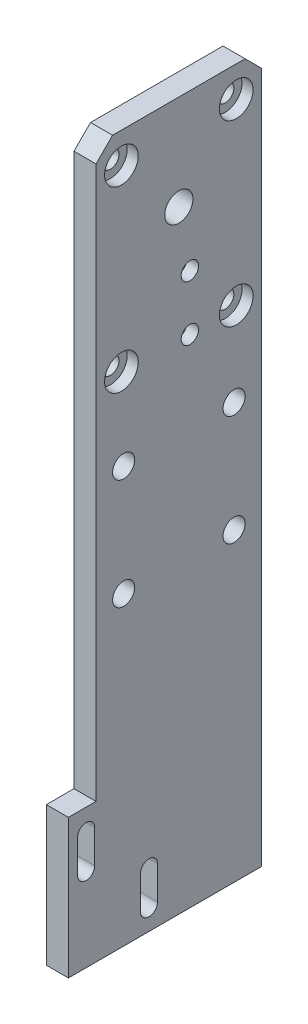
ISO-10303-21;
HEADER;
FILE_DESCRIPTION(('STEP AP214'),'2;1');
FILE_NAME('part.step','',(''),(''),'','','');
FILE_SCHEMA(('AUTOMOTIVE_DESIGN { 1 0 10303 214 1 1 1 1 }'));
ENDSEC;
DATA;
#1=APPLICATION_CONTEXT('core data for automotive mechanical design processes');
#2=APPLICATION_PROTOCOL_DEFINITION('international standard','automotive_design',2000,#1);
#3=PRODUCT_CONTEXT('',#1,'mechanical');
#4=PRODUCT('Part','Part','',(#3));
#5=PRODUCT_RELATED_PRODUCT_CATEGORY('part','',(#4));
#6=PRODUCT_DEFINITION_FORMATION('','',#4);
#7=PRODUCT_DEFINITION_CONTEXT('part definition',#1,'design');
#8=PRODUCT_DEFINITION('design','',#6,#7);
#9=PRODUCT_DEFINITION_SHAPE('','',#8);
#10=(LENGTH_UNIT() NAMED_UNIT(*) SI_UNIT(.MILLI.,.METRE.));
#11=(NAMED_UNIT(*) PLANE_ANGLE_UNIT() SI_UNIT($,.RADIAN.));
#12=(NAMED_UNIT(*) SI_UNIT($,.STERADIAN.) SOLID_ANGLE_UNIT());
#13=UNCERTAINTY_MEASURE_WITH_UNIT(LENGTH_MEASURE(1.E-05),#10,'distance_accuracy_value','');
#14=(GEOMETRIC_REPRESENTATION_CONTEXT(3) GLOBAL_UNCERTAINTY_ASSIGNED_CONTEXT((#13)) GLOBAL_UNIT_ASSIGNED_CONTEXT((#10,
#11,#12)) REPRESENTATION_CONTEXT('',''));
#15=CARTESIAN_POINT('',(0.,0.,0.));
#16=DIRECTION('',(0.,0.,1.));
#17=DIRECTION('',(1.,0.,0.));
#18=AXIS2_PLACEMENT_3D('',#15,#16,#17);
#19=CARTESIAN_POINT('',(-4.99999999997031E-05,25.1,10.4));
#20=DIRECTION('',(1.,0.,0.));
#21=DIRECTION('',(0.,0.,-1.));
#22=AXIS2_PLACEMENT_3D('',#19,#20,#21);
#23=CYLINDRICAL_SURFACE('',#22,1.575);
#24=CARTESIAN_POINT('',(0.,25.1,10.4));
#25=DIRECTION('',(-1.,0.,0.));
#26=DIRECTION('',(0.,0.,1.));
#27=AXIS2_PLACEMENT_3D('',#24,#25,#26);
#28=CIRCLE('',#27,1.575);
#29=CARTESIAN_POINT('',(0.,25.1,11.975));
#30=VERTEX_POINT('',#29);
#31=EDGE_CURVE('E314',#30,#30,#28,.T.);
#32=ORIENTED_EDGE('',*,*,#31,.T.);
#33=EDGE_LOOP('',(#32));
#34=FACE_BOUND('',#33,.T.);
#35=CARTESIAN_POINT('',(2.,25.1,10.4));
#36=DIRECTION('',(1.,0.,0.));
#37=DIRECTION('',(0.,0.,-1.));
#38=AXIS2_PLACEMENT_3D('',#35,#36,#37);
#39=CIRCLE('',#38,1.575);
#40=CARTESIAN_POINT('',(2.,25.1,8.825));
#41=VERTEX_POINT('',#40);
#42=EDGE_CURVE('E36',#41,#41,#39,.F.);
#43=ORIENTED_EDGE('',*,*,#42,.F.);
#44=EDGE_LOOP('',(#43));
#45=FACE_BOUND('',#44,.T.);
#46=ADVANCED_FACE('F32',(#34,#45),#23,.F.);
#47=CARTESIAN_POINT('',(-4.99999999997031E-05,25.1,-10.4));
#48=DIRECTION('',(1.,0.,0.));
#49=DIRECTION('',(0.,0.,-1.));
#50=AXIS2_PLACEMENT_3D('',#47,#48,#49);
#51=CYLINDRICAL_SURFACE('',#50,1.575);
#52=CARTESIAN_POINT('',(0.,25.1,-10.4));
#53=DIRECTION('',(-1.,0.,0.));
#54=DIRECTION('',(0.,0.,1.));
#55=AXIS2_PLACEMENT_3D('',#52,#53,#54);
#56=CIRCLE('',#55,1.575);
#57=CARTESIAN_POINT('',(0.,25.1,-8.825));
#58=VERTEX_POINT('',#57);
#59=EDGE_CURVE('E317',#58,#58,#56,.T.);
#60=ORIENTED_EDGE('',*,*,#59,.T.);
#61=EDGE_LOOP('',(#60));
#62=FACE_BOUND('',#61,.T.);
#63=CARTESIAN_POINT('',(2.,25.1,-10.4));
#64=DIRECTION('',(1.,0.,0.));
#65=DIRECTION('',(0.,0.,-1.));
#66=AXIS2_PLACEMENT_3D('',#63,#64,#65);
#67=CIRCLE('',#66,1.575);
#68=CARTESIAN_POINT('',(2.,25.1,-11.975));
#69=VERTEX_POINT('',#68);
#70=EDGE_CURVE('E185',#69,#69,#67,.F.);
#71=ORIENTED_EDGE('',*,*,#70,.F.);
#72=EDGE_LOOP('',(#71));
#73=FACE_BOUND('',#72,.T.);
#74=ADVANCED_FACE('F359',(#62,#73),#51,.F.);
#75=CARTESIAN_POINT('',(-4.99999999997031E-05,57.45,-10.4));
#76=DIRECTION('',(1.,0.,0.));
#77=DIRECTION('',(0.,0.,-1.));
#78=AXIS2_PLACEMENT_3D('',#75,#76,#77);
#79=CYLINDRICAL_SURFACE('',#78,1.575);
#80=CARTESIAN_POINT('',(0.,57.45,-10.4));
#81=DIRECTION('',(-1.,0.,0.));
#82=DIRECTION('',(0.,0.,1.));
#83=AXIS2_PLACEMENT_3D('',#80,#81,#82);
#84=CIRCLE('',#83,1.575);
#85=CARTESIAN_POINT('',(0.,57.45,-8.825));
#86=VERTEX_POINT('',#85);
#87=EDGE_CURVE('E311',#86,#86,#84,.T.);
#88=ORIENTED_EDGE('',*,*,#87,.T.);
#89=EDGE_LOOP('',(#88));
#90=FACE_BOUND('',#89,.T.);
#91=CARTESIAN_POINT('',(2.,57.45,-10.4));
#92=DIRECTION('',(1.,0.,0.));
#93=DIRECTION('',(0.,0.,-1.));
#94=AXIS2_PLACEMENT_3D('',#91,#92,#93);
#95=CIRCLE('',#94,1.575);
#96=CARTESIAN_POINT('',(2.,57.45,-11.975));
#97=VERTEX_POINT('',#96);
#98=EDGE_CURVE('E192',#97,#97,#95,.F.);
#99=ORIENTED_EDGE('',*,*,#98,.F.);
#100=EDGE_LOOP('',(#99));
#101=FACE_BOUND('',#100,.T.);
#102=ADVANCED_FACE('F361',(#90,#101),#79,.F.);
#103=CARTESIAN_POINT('',(-4.99999999997031E-05,57.45,10.4));
#104=DIRECTION('',(1.,0.,0.));
#105=DIRECTION('',(0.,0.,-1.));
#106=AXIS2_PLACEMENT_3D('',#103,#104,#105);
#107=CYLINDRICAL_SURFACE('',#106,1.575);
#108=CARTESIAN_POINT('',(0.,57.45,10.4));
#109=DIRECTION('',(-1.,0.,0.));
#110=DIRECTION('',(0.,0.,1.));
#111=AXIS2_PLACEMENT_3D('',#108,#109,#110);
#112=CIRCLE('',#111,1.575);
#113=CARTESIAN_POINT('',(0.,57.45,11.975));
#114=VERTEX_POINT('',#113);
#115=EDGE_CURVE('E221',#114,#114,#112,.T.);
#116=ORIENTED_EDGE('',*,*,#115,.T.);
#117=EDGE_LOOP('',(#116));
#118=FACE_BOUND('',#117,.T.);
#119=CARTESIAN_POINT('',(2.,57.45,10.4));
#120=DIRECTION('',(1.,0.,0.));
#121=DIRECTION('',(0.,0.,-1.));
#122=AXIS2_PLACEMENT_3D('',#119,#120,#121);
#123=CIRCLE('',#122,1.575);
#124=CARTESIAN_POINT('',(2.,57.45,8.825));
#125=VERTEX_POINT('',#124);
#126=EDGE_CURVE('E199',#125,#125,#123,.F.);
#127=ORIENTED_EDGE('',*,*,#126,.F.);
#128=EDGE_LOOP('',(#127));
#129=FACE_BOUND('',#128,.T.);
#130=ADVANCED_FACE('F368',(#118,#129),#107,.F.);
#131=CARTESIAN_POINT('',(-4.99999999997031E-05,34.75,-2.));
#132=DIRECTION('',(1.,0.,0.));
#133=DIRECTION('',(0.,0.,-1.));
#134=AXIS2_PLACEMENT_3D('',#131,#132,#133);
#135=CYLINDRICAL_SURFACE('',#134,1.575);
#136=CARTESIAN_POINT('',(4.,34.75,-2.));
#137=DIRECTION('',(1.,0.,0.));
#138=DIRECTION('',(0.,0.,-1.));
#139=AXIS2_PLACEMENT_3D('',#136,#137,#138);
#140=CIRCLE('',#139,1.575);
#141=CARTESIAN_POINT('',(4.,34.75,-3.575));
#142=VERTEX_POINT('',#141);
#143=EDGE_CURVE('E220',#142,#142,#140,.T.);
#144=ORIENTED_EDGE('',*,*,#143,.T.);
#145=EDGE_LOOP('',(#144));
#146=FACE_BOUND('',#145,.T.);
#147=CARTESIAN_POINT('',(1.9,34.75,-2.));
#148=DIRECTION('',(-1.,0.,0.));
#149=DIRECTION('',(0.,0.,1.));
#150=AXIS2_PLACEMENT_3D('',#147,#148,#149);
#151=CIRCLE('',#150,1.575);
#152=CARTESIAN_POINT('',(1.9,34.75,-0.424999999999998));
#153=VERTEX_POINT('',#152);
#154=EDGE_CURVE('E206',#153,#153,#151,.F.);
#155=ORIENTED_EDGE('',*,*,#154,.F.);
#156=EDGE_LOOP('',(#155));
#157=FACE_BOUND('',#156,.T.);
#158=ADVANCED_FACE('F379',(#146,#157),#135,.F.);
#159=CARTESIAN_POINT('',(-4.99999999997031E-05,24.75,-2.));
#160=DIRECTION('',(1.,0.,0.));
#161=DIRECTION('',(0.,0.,-1.));
#162=AXIS2_PLACEMENT_3D('',#159,#160,#161);
#163=CYLINDRICAL_SURFACE('',#162,1.575);
#164=CARTESIAN_POINT('',(4.,24.75,-2.));
#165=DIRECTION('',(1.,0.,0.));
#166=DIRECTION('',(0.,0.,-1.));
#167=AXIS2_PLACEMENT_3D('',#164,#165,#166);
#168=CIRCLE('',#167,1.575);
#169=CARTESIAN_POINT('',(4.,24.75,-3.575));
#170=VERTEX_POINT('',#169);
#171=EDGE_CURVE('E217',#170,#170,#168,.T.);
#172=ORIENTED_EDGE('',*,*,#171,.T.);
#173=EDGE_LOOP('',(#172));
#174=FACE_BOUND('',#173,.T.);
#175=CARTESIAN_POINT('',(1.9,24.75,-2.));
#176=DIRECTION('',(-1.,0.,0.));
#177=DIRECTION('',(0.,0.,1.));
#178=AXIS2_PLACEMENT_3D('',#175,#176,#177);
#179=CIRCLE('',#178,1.575);
#180=CARTESIAN_POINT('',(1.9,24.75,-0.424999999999999));
#181=VERTEX_POINT('',#180);
#182=EDGE_CURVE('E213',#181,#181,#179,.F.);
#183=ORIENTED_EDGE('',*,*,#182,.F.);
#184=EDGE_LOOP('',(#183));
#185=FACE_BOUND('',#184,.T.);
#186=ADVANCED_FACE('F381',(#174,#185),#163,.F.);
#187=CARTESIAN_POINT('',(4.,-63.,15.));
#188=DIRECTION('',(0.,0.,-1.));
#189=DIRECTION('',(-1.,0.,0.));
#190=AXIS2_PLACEMENT_3D('',#187,#188,#189);
#191=PLANE('',#190);
#192=DIRECTION('',(0.,-1.,0.));
#193=VECTOR('',#192,1.);
#194=CARTESIAN_POINT('',(4.,-63.,15.));
#195=LINE('',#194,#193);
#196=CARTESIAN_POINT('',(4.,60.,15.));
#197=VERTEX_POINT('',#196);
#198=CARTESIAN_POINT('',(4.,-40.,15.));
#199=VERTEX_POINT('',#198);
#200=EDGE_CURVE('E292',#197,#199,#195,.T.);
#201=ORIENTED_EDGE('',*,*,#200,.F.);
#202=DIRECTION('',(-1.,0.,0.));
#203=VECTOR('',#202,1.);
#204=CARTESIAN_POINT('',(4.,60.,15.));
#205=LINE('',#204,#203);
#206=CARTESIAN_POINT('',(0.,60.,15.));
#207=VERTEX_POINT('',#206);
#208=EDGE_CURVE('E11',#197,#207,#205,.T.);
#209=ORIENTED_EDGE('',*,*,#208,.T.);
#210=DIRECTION('',(0.,-1.,0.));
#211=VECTOR('',#210,1.);
#212=CARTESIAN_POINT('',(0.,-63.,15.));
#213=LINE('',#212,#211);
#214=CARTESIAN_POINT('',(0.,-40.,15.));
#215=VERTEX_POINT('',#214);
#216=EDGE_CURVE('E325',#207,#215,#213,.T.);
#217=ORIENTED_EDGE('',*,*,#216,.T.);
#218=DIRECTION('',(-1.,0.,0.));
#219=VECTOR('',#218,1.);
#220=CARTESIAN_POINT('',(27.5372045918796,-40.,15.));
#221=LINE('',#220,#219);
#222=EDGE_CURVE('E268',#199,#215,#221,.T.);
#223=ORIENTED_EDGE('',*,*,#222,.F.);
#224=EDGE_LOOP('',(#201,#209,#217,#223));
#225=FACE_BOUND('',#224,.T.);
#226=ADVANCED_FACE('F384',(#225),#191,.F.);
#227=CARTESIAN_POINT('',(4.,-63.,-15.));
#228=DIRECTION('',(0.,0.,1.));
#229=DIRECTION('',(1.,0.,0.));
#230=AXIS2_PLACEMENT_3D('',#227,#228,#229);
#231=PLANE('',#230);
#232=DIRECTION('',(0.,1.,0.));
#233=VECTOR('',#232,1.);
#234=CARTESIAN_POINT('',(0.,-63.,-15.));
#235=LINE('',#234,#233);
#236=CARTESIAN_POINT('',(0.,-65.2,-15.));
#237=VERTEX_POINT('',#236);
#238=CARTESIAN_POINT('',(0.,60.,-15.));
#239=VERTEX_POINT('',#238);
#240=EDGE_CURVE('E148',#237,#239,#235,.T.);
#241=ORIENTED_EDGE('',*,*,#240,.T.);
#242=DIRECTION('',(1.,0.,0.));
#243=VECTOR('',#242,1.);
#244=CARTESIAN_POINT('',(4.,60.,-15.));
#245=LINE('',#244,#243);
#246=CARTESIAN_POINT('',(4.,60.,-15.));
#247=VERTEX_POINT('',#246);
#248=EDGE_CURVE('E57',#239,#247,#245,.T.);
#249=ORIENTED_EDGE('',*,*,#248,.T.);
#250=DIRECTION('',(0.,1.,0.));
#251=VECTOR('',#250,1.);
#252=CARTESIAN_POINT('',(4.,-63.,-15.));
#253=LINE('',#252,#251);
#254=CARTESIAN_POINT('',(4.,-65.2,-15.));
#255=VERTEX_POINT('',#254);
#256=EDGE_CURVE('E163',#255,#247,#253,.T.);
#257=ORIENTED_EDGE('',*,*,#256,.F.);
#258=DIRECTION('',(1.,0.,0.));
#259=VECTOR('',#258,1.);
#260=CARTESIAN_POINT('',(-35.0690746955205,-65.2,-15.));
#261=LINE('',#260,#259);
#262=EDGE_CURVE('E161',#237,#255,#261,.T.);
#263=ORIENTED_EDGE('',*,*,#262,.F.);
#264=EDGE_LOOP('',(#241,#249,#257,#263));
#265=FACE_BOUND('',#264,.T.);
#266=ADVANCED_FACE('F162',(#265),#231,.F.);
#267=CARTESIAN_POINT('',(4.,63.,15.));
#268=DIRECTION('',(0.,-1.,0.));
#269=DIRECTION('',(0.,0.,-1.));
#270=AXIS2_PLACEMENT_3D('',#267,#268,#269);
#271=PLANE('',#270);
#272=DIRECTION('',(0.,0.,1.));
#273=VECTOR('',#272,1.);
#274=CARTESIAN_POINT('',(4.,63.,15.));
#275=LINE('',#274,#273);
#276=CARTESIAN_POINT('',(4.,63.,-12.));
#277=VERTEX_POINT('',#276);
#278=CARTESIAN_POINT('',(4.,63.,12.));
#279=VERTEX_POINT('',#278);
#280=EDGE_CURVE('E332',#277,#279,#275,.T.);
#281=ORIENTED_EDGE('',*,*,#280,.F.);
#282=DIRECTION('',(-1.,0.,0.));
#283=VECTOR('',#282,1.);
#284=CARTESIAN_POINT('',(4.,63.,-12.));
#285=LINE('',#284,#283);
#286=CARTESIAN_POINT('',(0.,63.,-12.));
#287=VERTEX_POINT('',#286);
#288=EDGE_CURVE('E321',#277,#287,#285,.T.);
#289=ORIENTED_EDGE('',*,*,#288,.T.);
#290=DIRECTION('',(0.,0.,1.));
#291=VECTOR('',#290,1.);
#292=CARTESIAN_POINT('',(0.,63.,15.));
#293=LINE('',#292,#291);
#294=CARTESIAN_POINT('',(0.,63.,12.));
#295=VERTEX_POINT('',#294);
#296=EDGE_CURVE('E157',#287,#295,#293,.T.);
#297=ORIENTED_EDGE('',*,*,#296,.T.);
#298=DIRECTION('',(1.,0.,0.));
#299=VECTOR('',#298,1.);
#300=CARTESIAN_POINT('',(4.,63.,12.));
#301=LINE('',#300,#299);
#302=EDGE_CURVE('E308',#295,#279,#301,.T.);
#303=ORIENTED_EDGE('',*,*,#302,.T.);
#304=EDGE_LOOP('',(#281,#289,#297,#303));
#305=FACE_BOUND('',#304,.T.);
#306=ADVANCED_FACE('F341',(#305),#271,.F.);
#307=CARTESIAN_POINT('',(4.,0.,0.));
#308=DIRECTION('',(-1.,0.,0.));
#309=DIRECTION('',(0.,0.,1.));
#310=AXIS2_PLACEMENT_3D('',#307,#308,#309);
#311=PLANE('',#310);
#312=CARTESIAN_POINT('',(4.,25.1,10.4));
#313=DIRECTION('',(1.,0.,0.));
#314=DIRECTION('',(0.,0.,-1.));
#315=AXIS2_PLACEMENT_3D('',#312,#313,#314);
#316=CIRCLE('',#315,3.05);
#317=CARTESIAN_POINT('',(4.,25.1,7.35));
#318=VERTEX_POINT('',#317);
#319=EDGE_CURVE('E176',#318,#318,#316,.T.);
#320=ORIENTED_EDGE('',*,*,#319,.F.);
#321=EDGE_LOOP('',(#320));
#322=FACE_BOUND('',#321,.T.);
#323=CARTESIAN_POINT('',(4.,25.1,-10.4));
#324=DIRECTION('',(1.,0.,0.));
#325=DIRECTION('',(0.,0.,-1.));
#326=AXIS2_PLACEMENT_3D('',#323,#324,#325);
#327=CIRCLE('',#326,3.05);
#328=CARTESIAN_POINT('',(4.,25.1,-13.45));
#329=VERTEX_POINT('',#328);
#330=EDGE_CURVE('E186',#329,#329,#327,.T.);
#331=ORIENTED_EDGE('',*,*,#330,.F.);
#332=EDGE_LOOP('',(#331));
#333=FACE_BOUND('',#332,.T.);
#334=CARTESIAN_POINT('',(4.,57.45,-10.4));
#335=DIRECTION('',(1.,0.,0.));
#336=DIRECTION('',(0.,0.,-1.));
#337=AXIS2_PLACEMENT_3D('',#334,#335,#336);
#338=CIRCLE('',#337,3.05);
#339=CARTESIAN_POINT('',(4.,57.45,-13.45));
#340=VERTEX_POINT('',#339);
#341=EDGE_CURVE('E193',#340,#340,#338,.T.);
#342=ORIENTED_EDGE('',*,*,#341,.F.);
#343=EDGE_LOOP('',(#342));
#344=FACE_BOUND('',#343,.T.);
#345=CARTESIAN_POINT('',(4.,57.45,10.4));
#346=DIRECTION('',(1.,0.,0.));
#347=DIRECTION('',(0.,0.,-1.));
#348=AXIS2_PLACEMENT_3D('',#345,#346,#347);
#349=CIRCLE('',#348,3.04999999999999);
#350=CARTESIAN_POINT('',(4.,57.45,7.35000000000001));
#351=VERTEX_POINT('',#350);
#352=EDGE_CURVE('E200',#351,#351,#349,.T.);
#353=ORIENTED_EDGE('',*,*,#352,.F.);
#354=EDGE_LOOP('',(#353));
#355=FACE_BOUND('',#354,.T.);
#356=ORIENTED_EDGE('',*,*,#171,.F.);
#357=EDGE_LOOP('',(#356));
#358=FACE_BOUND('',#357,.T.);
#359=ORIENTED_EDGE('',*,*,#143,.F.);
#360=EDGE_LOOP('',(#359));
#361=FACE_BOUND('',#360,.T.);
#362=DIRECTION('',(0.,-1.,0.));
#363=VECTOR('',#362,1.);
#364=CARTESIAN_POINT('',(4.,-55.3437084989847,6.95718189636012));
#365=LINE('',#364,#363);
#366=CARTESIAN_POINT('',(4.,-55.3437084989847,6.95718189636012));
#367=VERTEX_POINT('',#366);
#368=CARTESIAN_POINT('',(4.,-61.3437084989847,6.95718189636012));
#369=VERTEX_POINT('',#368);
#370=EDGE_CURVE('E226',#367,#369,#365,.T.);
#371=ORIENTED_EDGE('',*,*,#370,.F.);
#372=CARTESIAN_POINT('',(4.,-55.3437084989847,5.40718189636012));
#373=DIRECTION('',(1.,0.,0.));
#374=DIRECTION('',(0.,0.,-1.));
#375=AXIS2_PLACEMENT_3D('',#372,#373,#374);
#376=CIRCLE('',#375,1.55);
#377=CARTESIAN_POINT('',(4.,-55.3437084989847,3.85718189636012));
#378=VERTEX_POINT('',#377);
#379=EDGE_CURVE('E224',#378,#367,#376,.T.);
#380=ORIENTED_EDGE('',*,*,#379,.F.);
#381=DIRECTION('',(0.,1.,0.));
#382=VECTOR('',#381,1.);
#383=CARTESIAN_POINT('',(4.,-55.3437084989847,3.85718189636012));
#384=LINE('',#383,#382);
#385=CARTESIAN_POINT('',(4.,-61.3437084989847,3.85718189636012));
#386=VERTEX_POINT('',#385);
#387=EDGE_CURVE('E232',#386,#378,#384,.T.);
#388=ORIENTED_EDGE('',*,*,#387,.F.);
#389=CARTESIAN_POINT('',(4.,-61.3437084989847,5.40718189636012));
#390=DIRECTION('',(1.,0.,0.));
#391=DIRECTION('',(0.,0.,-1.));
#392=AXIS2_PLACEMENT_3D('',#389,#390,#391);
#393=CIRCLE('',#392,1.55);
#394=EDGE_CURVE('E229',#369,#386,#393,.T.);
#395=ORIENTED_EDGE('',*,*,#394,.F.);
#396=EDGE_LOOP('',(#371,#380,#388,#395));
#397=FACE_BOUND('',#396,.T.);
#398=DIRECTION('',(0.,-1.,0.));
#399=VECTOR('',#398,1.);
#400=CARTESIAN_POINT('',(4.,-43.96,18.3408903953449));
#401=LINE('',#400,#399);
#402=CARTESIAN_POINT('',(4.,-43.96,18.3408903953449));
#403=VERTEX_POINT('',#402);
#404=CARTESIAN_POINT('',(4.,-49.96,18.3408903953449));
#405=VERTEX_POINT('',#404);
#406=EDGE_CURVE('E246',#403,#405,#401,.T.);
#407=ORIENTED_EDGE('',*,*,#406,.F.);
#408=CARTESIAN_POINT('',(4.,-43.96,16.7908903953449));
#409=DIRECTION('',(1.,0.,0.));
#410=DIRECTION('',(0.,0.,-1.));
#411=AXIS2_PLACEMENT_3D('',#408,#409,#410);
#412=CIRCLE('',#411,1.55);
#413=CARTESIAN_POINT('',(4.,-43.96,15.2408903953449));
#414=VERTEX_POINT('',#413);
#415=EDGE_CURVE('E238',#414,#403,#412,.T.);
#416=ORIENTED_EDGE('',*,*,#415,.F.);
#417=DIRECTION('',(0.,1.,0.));
#418=VECTOR('',#417,1.);
#419=CARTESIAN_POINT('',(4.,-43.96,15.2408903953449));
#420=LINE('',#419,#418);
#421=CARTESIAN_POINT('',(4.,-49.96,15.2408903953449));
#422=VERTEX_POINT('',#421);
#423=EDGE_CURVE('E252',#422,#414,#420,.T.);
#424=ORIENTED_EDGE('',*,*,#423,.F.);
#425=CARTESIAN_POINT('',(4.,-49.96,16.7908903953449));
#426=DIRECTION('',(1.,0.,0.));
#427=DIRECTION('',(0.,0.,-1.));
#428=AXIS2_PLACEMENT_3D('',#425,#426,#427);
#429=CIRCLE('',#428,1.55);
#430=EDGE_CURVE('E249',#405,#422,#429,.T.);
#431=ORIENTED_EDGE('',*,*,#430,.F.);
#432=EDGE_LOOP('',(#407,#416,#424,#431));
#433=FACE_BOUND('',#432,.T.);
#434=CARTESIAN_POINT('',(4.,45.75,0.));
#435=DIRECTION('',(-1.,0.,0.));
#436=DIRECTION('',(0.,0.,1.));
#437=AXIS2_PLACEMENT_3D('',#434,#435,#436);
#438=CIRCLE('',#437,2.54999999999999);
#439=CARTESIAN_POINT('',(4.,45.75,2.54999999999999));
#440=VERTEX_POINT('',#439);
#441=EDGE_CURVE('E804',#440,#440,#438,.T.);
#442=ORIENTED_EDGE('',*,*,#441,.T.);
#443=EDGE_LOOP('',(#442));
#444=FACE_BOUND('',#443,.T.);
#445=CARTESIAN_POINT('',(4.,-9.90000000000001,-10.));
#446=DIRECTION('',(1.,0.,0.));
#447=DIRECTION('',(0.,0.,-1.));
#448=AXIS2_PLACEMENT_3D('',#445,#446,#447);
#449=CIRCLE('',#448,2.00000000000001);
#450=CARTESIAN_POINT('',(4.,-9.90000000000001,-12.));
#451=VERTEX_POINT('',#450);
#452=EDGE_CURVE('E808',#451,#451,#449,.T.);
#453=ORIENTED_EDGE('',*,*,#452,.F.);
#454=EDGE_LOOP('',(#453));
#455=FACE_BOUND('',#454,.T.);
#456=CARTESIAN_POINT('',(4.,-9.90000000000001,10.));
#457=DIRECTION('',(1.,0.,0.));
#458=DIRECTION('',(0.,0.,-1.));
#459=AXIS2_PLACEMENT_3D('',#456,#457,#458);
#460=CIRCLE('',#459,2.);
#461=CARTESIAN_POINT('',(4.,-9.90000000000001,8.));
#462=VERTEX_POINT('',#461);
#463=EDGE_CURVE('E812',#462,#462,#460,.T.);
#464=ORIENTED_EDGE('',*,*,#463,.F.);
#465=EDGE_LOOP('',(#464));
#466=FACE_BOUND('',#465,.T.);
#467=CARTESIAN_POINT('',(4.,10.1,-10.));
#468=DIRECTION('',(1.,0.,0.));
#469=DIRECTION('',(0.,0.,-1.));
#470=AXIS2_PLACEMENT_3D('',#467,#468,#469);
#471=CIRCLE('',#470,2.00000000000001);
#472=CARTESIAN_POINT('',(4.,10.1,-12.));
#473=VERTEX_POINT('',#472);
#474=EDGE_CURVE('E816',#473,#473,#471,.T.);
#475=ORIENTED_EDGE('',*,*,#474,.F.);
#476=EDGE_LOOP('',(#475));
#477=FACE_BOUND('',#476,.T.);
#478=CARTESIAN_POINT('',(4.,10.1,10.));
#479=DIRECTION('',(1.,0.,0.));
#480=DIRECTION('',(0.,0.,-1.));
#481=AXIS2_PLACEMENT_3D('',#478,#479,#480);
#482=CIRCLE('',#481,2.);
#483=CARTESIAN_POINT('',(4.,10.1,8.));
#484=VERTEX_POINT('',#483);
#485=EDGE_CURVE('E819',#484,#484,#482,.T.);
#486=ORIENTED_EDGE('',*,*,#485,.F.);
#487=EDGE_LOOP('',(#486));
#488=FACE_BOUND('',#487,.T.);
#489=ORIENTED_EDGE('',*,*,#256,.T.);
#490=DIRECTION('',(0.,-0.707106781186549,-0.707106781186546));
#491=VECTOR('',#490,1.);
#492=CARTESIAN_POINT('',(4.,63.,-12.));
#493=LINE('',#492,#491);
#494=EDGE_CURVE('E41',#247,#277,#493,.F.);
#495=ORIENTED_EDGE('',*,*,#494,.T.);
#496=ORIENTED_EDGE('',*,*,#280,.T.);
#497=DIRECTION('',(0.,0.707106781186544,-0.707106781186551));
#498=VECTOR('',#497,1.);
#499=CARTESIAN_POINT('',(4.,60.,15.));
#500=LINE('',#499,#498);
#501=EDGE_CURVE('E49',#279,#197,#500,.F.);
#502=ORIENTED_EDGE('',*,*,#501,.T.);
#503=ORIENTED_EDGE('',*,*,#200,.T.);
#504=DIRECTION('',(0.,0.,1.));
#505=VECTOR('',#504,1.);
#506=CARTESIAN_POINT('',(4.,-40.,15.));
#507=LINE('',#506,#505);
#508=CARTESIAN_POINT('',(4.,-40.,20.));
#509=VERTEX_POINT('',#508);
#510=EDGE_CURVE('E267',#199,#509,#507,.T.);
#511=ORIENTED_EDGE('',*,*,#510,.T.);
#512=DIRECTION('',(0.,-1.,0.));
#513=VECTOR('',#512,1.);
#514=CARTESIAN_POINT('',(4.,-63.,20.));
#515=LINE('',#514,#513);
#516=CARTESIAN_POINT('',(4.,-65.2,20.));
#517=VERTEX_POINT('',#516);
#518=EDGE_CURVE('E265',#509,#517,#515,.T.);
#519=ORIENTED_EDGE('',*,*,#518,.T.);
#520=DIRECTION('',(0.,0.,-1.));
#521=VECTOR('',#520,1.);
#522=CARTESIAN_POINT('',(4.,-65.2,20.));
#523=LINE('',#522,#521);
#524=EDGE_CURVE('E171',#517,#255,#523,.T.);
#525=ORIENTED_EDGE('',*,*,#524,.T.);
#526=EDGE_LOOP('',(#489,#495,#496,#502,#503,#511,#519,#525));
#527=FACE_BOUND('',#526,.T.);
#528=ADVANCED_FACE('F450',(#322,#333,#344,#355,#358,#361,#397,#433,#444,#455,#466,#477,#488,
#527),#311,.F.);
#529=CARTESIAN_POINT('',(0.,0.,0.));
#530=DIRECTION('',(-1.,0.,0.));
#531=DIRECTION('',(0.,0.,1.));
#532=AXIS2_PLACEMENT_3D('',#529,#530,#531);
#533=PLANE('',#532);
#534=CARTESIAN_POINT('',(0.,34.75,-2.));
#535=DIRECTION('',(-1.,0.,0.));
#536=DIRECTION('',(0.,0.,1.));
#537=AXIS2_PLACEMENT_3D('',#534,#535,#536);
#538=CIRCLE('',#537,3.50000000000001);
#539=CARTESIAN_POINT('',(0.,34.75,1.50000000000001));
#540=VERTEX_POINT('',#539);
#541=EDGE_CURVE('E207',#540,#540,#538,.T.);
#542=ORIENTED_EDGE('',*,*,#541,.F.);
#543=EDGE_LOOP('',(#542));
#544=FACE_BOUND('',#543,.T.);
#545=CARTESIAN_POINT('',(0.,24.75,-2.));
#546=DIRECTION('',(-1.,0.,0.));
#547=DIRECTION('',(0.,0.,1.));
#548=AXIS2_PLACEMENT_3D('',#545,#546,#547);
#549=CIRCLE('',#548,3.5);
#550=CARTESIAN_POINT('',(0.,24.75,1.5));
#551=VERTEX_POINT('',#550);
#552=EDGE_CURVE('E214',#551,#551,#549,.T.);
#553=ORIENTED_EDGE('',*,*,#552,.F.);
#554=EDGE_LOOP('',(#553));
#555=FACE_BOUND('',#554,.T.);
#556=ORIENTED_EDGE('',*,*,#59,.F.);
#557=EDGE_LOOP('',(#556));
#558=FACE_BOUND('',#557,.T.);
#559=ORIENTED_EDGE('',*,*,#31,.F.);
#560=EDGE_LOOP('',(#559));
#561=FACE_BOUND('',#560,.T.);
#562=ORIENTED_EDGE('',*,*,#87,.F.);
#563=EDGE_LOOP('',(#562));
#564=FACE_BOUND('',#563,.T.);
#565=ORIENTED_EDGE('',*,*,#115,.F.);
#566=EDGE_LOOP('',(#565));
#567=FACE_BOUND('',#566,.T.);
#568=CARTESIAN_POINT('',(0.,-55.3437084989847,5.40718189636012));
#569=DIRECTION('',(-1.,0.,0.));
#570=DIRECTION('',(0.,0.,1.));
#571=AXIS2_PLACEMENT_3D('',#568,#569,#570);
#572=CIRCLE('',#571,1.55);
#573=CARTESIAN_POINT('',(0.,-55.3437084989847,6.95718189636012));
#574=VERTEX_POINT('',#573);
#575=CARTESIAN_POINT('',(0.,-55.3437084989847,3.85718189636012));
#576=VERTEX_POINT('',#575);
#577=EDGE_CURVE('E306',#574,#576,#572,.T.);
#578=ORIENTED_EDGE('',*,*,#577,.F.);
#579=DIRECTION('',(0.,1.,0.));
#580=VECTOR('',#579,1.);
#581=CARTESIAN_POINT('',(0.,0.,6.95718189636012));
#582=LINE('',#581,#580);
#583=CARTESIAN_POINT('',(0.,-61.3437084989847,6.95718189636012));
#584=VERTEX_POINT('',#583);
#585=EDGE_CURVE('E299',#584,#574,#582,.T.);
#586=ORIENTED_EDGE('',*,*,#585,.F.);
#587=CARTESIAN_POINT('',(0.,-61.3437084989847,5.40718189636012));
#588=DIRECTION('',(-1.,0.,0.));
#589=DIRECTION('',(0.,0.,1.));
#590=AXIS2_PLACEMENT_3D('',#587,#588,#589);
#591=CIRCLE('',#590,1.55);
#592=CARTESIAN_POINT('',(0.,-61.3437084989847,3.85718189636012));
#593=VERTEX_POINT('',#592);
#594=EDGE_CURVE('E301',#593,#584,#591,.T.);
#595=ORIENTED_EDGE('',*,*,#594,.F.);
#596=DIRECTION('',(0.,-1.,0.));
#597=VECTOR('',#596,1.);
#598=CARTESIAN_POINT('',(0.,0.,3.85718189636012));
#599=LINE('',#598,#597);
#600=EDGE_CURVE('E304',#576,#593,#599,.T.);
#601=ORIENTED_EDGE('',*,*,#600,.F.);
#602=EDGE_LOOP('',(#578,#586,#595,#601));
#603=FACE_BOUND('',#602,.T.);
#604=CARTESIAN_POINT('',(0.,-43.96,16.7908903953449));
#605=DIRECTION('',(-1.,0.,0.));
#606=DIRECTION('',(0.,0.,1.));
#607=AXIS2_PLACEMENT_3D('',#604,#605,#606);
#608=CIRCLE('',#607,1.55);
#609=CARTESIAN_POINT('',(0.,-43.96,18.3408903953449));
#610=VERTEX_POINT('',#609);
#611=CARTESIAN_POINT('',(0.,-43.96,15.2408903953449));
#612=VERTEX_POINT('',#611);
#613=EDGE_CURVE('E297',#610,#612,#608,.T.);
#614=ORIENTED_EDGE('',*,*,#613,.F.);
#615=DIRECTION('',(0.,1.,0.));
#616=VECTOR('',#615,1.);
#617=CARTESIAN_POINT('',(0.,0.,18.3408903953449));
#618=LINE('',#617,#616);
#619=CARTESIAN_POINT('',(0.,-49.96,18.3408903953449));
#620=VERTEX_POINT('',#619);
#621=EDGE_CURVE('E289',#620,#610,#618,.T.);
#622=ORIENTED_EDGE('',*,*,#621,.F.);
#623=CARTESIAN_POINT('',(0.,-49.96,16.7908903953449));
#624=DIRECTION('',(-1.,0.,0.));
#625=DIRECTION('',(0.,0.,1.));
#626=AXIS2_PLACEMENT_3D('',#623,#624,#625);
#627=CIRCLE('',#626,1.55);
#628=CARTESIAN_POINT('',(0.,-49.96,15.2408903953449));
#629=VERTEX_POINT('',#628);
#630=EDGE_CURVE('E291',#629,#620,#627,.T.);
#631=ORIENTED_EDGE('',*,*,#630,.F.);
#632=DIRECTION('',(0.,-1.,0.));
#633=VECTOR('',#632,1.);
#634=CARTESIAN_POINT('',(0.,0.,15.2408903953449));
#635=LINE('',#634,#633);
#636=EDGE_CURVE('E295',#612,#629,#635,.T.);
#637=ORIENTED_EDGE('',*,*,#636,.F.);
#638=EDGE_LOOP('',(#614,#622,#631,#637));
#639=FACE_BOUND('',#638,.T.);
#640=CARTESIAN_POINT('',(0.,45.75,0.));
#641=DIRECTION('',(-1.,0.,0.));
#642=DIRECTION('',(0.,0.,1.));
#643=AXIS2_PLACEMENT_3D('',#640,#641,#642);
#644=CIRCLE('',#643,2.54999999999999);
#645=CARTESIAN_POINT('',(0.,45.75,2.54999999999999));
#646=VERTEX_POINT('',#645);
#647=EDGE_CURVE('E286',#646,#646,#644,.T.);
#648=ORIENTED_EDGE('',*,*,#647,.F.);
#649=EDGE_LOOP('',(#648));
#650=FACE_BOUND('',#649,.T.);
#651=CARTESIAN_POINT('',(0.,-9.90000000000001,-10.));
#652=DIRECTION('',(1.,0.,0.));
#653=DIRECTION('',(0.,0.,-1.));
#654=AXIS2_PLACEMENT_3D('',#651,#652,#653);
#655=CIRCLE('',#654,2.00000000000001);
#656=CARTESIAN_POINT('',(0.,-9.90000000000001,-12.));
#657=VERTEX_POINT('',#656);
#658=EDGE_CURVE('E830',#657,#657,#655,.T.);
#659=ORIENTED_EDGE('',*,*,#658,.T.);
#660=EDGE_LOOP('',(#659));
#661=FACE_BOUND('',#660,.T.);
#662=CARTESIAN_POINT('',(0.,-9.90000000000001,10.));
#663=DIRECTION('',(1.,0.,0.));
#664=DIRECTION('',(0.,0.,-1.));
#665=AXIS2_PLACEMENT_3D('',#662,#663,#664);
#666=CIRCLE('',#665,2.);
#667=CARTESIAN_POINT('',(0.,-9.90000000000001,8.));
#668=VERTEX_POINT('',#667);
#669=EDGE_CURVE('E826',#668,#668,#666,.T.);
#670=ORIENTED_EDGE('',*,*,#669,.T.);
#671=EDGE_LOOP('',(#670));
#672=FACE_BOUND('',#671,.T.);
#673=CARTESIAN_POINT('',(0.,10.1,-10.));
#674=DIRECTION('',(1.,0.,0.));
#675=DIRECTION('',(0.,0.,-1.));
#676=AXIS2_PLACEMENT_3D('',#673,#674,#675);
#677=CIRCLE('',#676,2.00000000000001);
#678=CARTESIAN_POINT('',(0.,10.1,-12.));
#679=VERTEX_POINT('',#678);
#680=EDGE_CURVE('E822',#679,#679,#677,.T.);
#681=ORIENTED_EDGE('',*,*,#680,.T.);
#682=EDGE_LOOP('',(#681));
#683=FACE_BOUND('',#682,.T.);
#684=CARTESIAN_POINT('',(0.,10.1,10.));
#685=DIRECTION('',(1.,0.,0.));
#686=DIRECTION('',(0.,0.,-1.));
#687=AXIS2_PLACEMENT_3D('',#684,#685,#686);
#688=CIRCLE('',#687,2.);
#689=CARTESIAN_POINT('',(0.,10.1,8.));
#690=VERTEX_POINT('',#689);
#691=EDGE_CURVE('E158',#690,#690,#688,.T.);
#692=ORIENTED_EDGE('',*,*,#691,.T.);
#693=EDGE_LOOP('',(#692));
#694=FACE_BOUND('',#693,.T.);
#695=ORIENTED_EDGE('',*,*,#296,.F.);
#696=DIRECTION('',(0.,0.707106781186549,0.707106781186546));
#697=VECTOR('',#696,1.);
#698=CARTESIAN_POINT('',(0.,37.4999999999999,-37.5));
#699=LINE('',#698,#697);
#700=EDGE_CURVE('E156',#287,#239,#699,.F.);
#701=ORIENTED_EDGE('',*,*,#700,.T.);
#702=ORIENTED_EDGE('',*,*,#240,.F.);
#703=DIRECTION('',(0.,0.,-1.));
#704=VECTOR('',#703,1.);
#705=CARTESIAN_POINT('',(0.,-65.2,20.));
#706=LINE('',#705,#704);
#707=CARTESIAN_POINT('',(0.,-65.2,20.));
#708=VERTEX_POINT('',#707);
#709=EDGE_CURVE('E154',#708,#237,#706,.T.);
#710=ORIENTED_EDGE('',*,*,#709,.F.);
#711=DIRECTION('',(0.,1.,0.));
#712=VECTOR('',#711,1.);
#713=CARTESIAN_POINT('',(0.,-63.,20.));
#714=LINE('',#713,#712);
#715=CARTESIAN_POINT('',(0.,-40.,20.));
#716=VERTEX_POINT('',#715);
#717=EDGE_CURVE('E258',#708,#716,#714,.T.);
#718=ORIENTED_EDGE('',*,*,#717,.T.);
#719=DIRECTION('',(0.,0.,-1.));
#720=VECTOR('',#719,1.);
#721=CARTESIAN_POINT('',(0.,-40.,15.));
#722=LINE('',#721,#720);
#723=EDGE_CURVE('E270',#716,#215,#722,.T.);
#724=ORIENTED_EDGE('',*,*,#723,.T.);
#725=ORIENTED_EDGE('',*,*,#216,.F.);
#726=DIRECTION('',(0.,-0.707106781186544,0.707106781186551));
#727=VECTOR('',#726,1.);
#728=CARTESIAN_POINT('',(0.,37.5000000000003,37.4999999999999));
#729=LINE('',#728,#727);
#730=EDGE_CURVE('E324',#207,#295,#729,.F.);
#731=ORIENTED_EDGE('',*,*,#730,.T.);
#732=EDGE_LOOP('',(#695,#701,#702,#710,#718,#724,#725,#731));
#733=FACE_BOUND('',#732,.T.);
#734=ADVANCED_FACE('F151',(#544,#555,#558,#561,#564,#567,#603,#639,#650,#661,#672,#683,#694,
#733),#533,.T.);
#735=CARTESIAN_POINT('',(0.,10.1,10.));
#736=DIRECTION('',(1.,0.,0.));
#737=DIRECTION('',(0.,0.,-1.));
#738=AXIS2_PLACEMENT_3D('',#735,#736,#737);
#739=CYLINDRICAL_SURFACE('',#738,2.);
#740=ORIENTED_EDGE('',*,*,#691,.F.);
#741=EDGE_LOOP('',(#740));
#742=FACE_BOUND('',#741,.T.);
#743=ORIENTED_EDGE('',*,*,#485,.T.);
#744=EDGE_LOOP('',(#743));
#745=FACE_BOUND('',#744,.T.);
#746=ADVANCED_FACE('F445',(#742,#745),#739,.F.);
#747=CARTESIAN_POINT('',(0.,10.1,-10.));
#748=DIRECTION('',(1.,0.,0.));
#749=DIRECTION('',(0.,0.,-1.));
#750=AXIS2_PLACEMENT_3D('',#747,#748,#749);
#751=CYLINDRICAL_SURFACE('',#750,2.00000000000001);
#752=ORIENTED_EDGE('',*,*,#680,.F.);
#753=EDGE_LOOP('',(#752));
#754=FACE_BOUND('',#753,.T.);
#755=ORIENTED_EDGE('',*,*,#474,.T.);
#756=EDGE_LOOP('',(#755));
#757=FACE_BOUND('',#756,.T.);
#758=ADVANCED_FACE('F441',(#754,#757),#751,.F.);
#759=CARTESIAN_POINT('',(0.,-9.90000000000001,10.));
#760=DIRECTION('',(1.,0.,0.));
#761=DIRECTION('',(0.,0.,-1.));
#762=AXIS2_PLACEMENT_3D('',#759,#760,#761);
#763=CYLINDRICAL_SURFACE('',#762,2.);
#764=ORIENTED_EDGE('',*,*,#669,.F.);
#765=EDGE_LOOP('',(#764));
#766=FACE_BOUND('',#765,.T.);
#767=ORIENTED_EDGE('',*,*,#463,.T.);
#768=EDGE_LOOP('',(#767));
#769=FACE_BOUND('',#768,.T.);
#770=ADVANCED_FACE('F437',(#766,#769),#763,.F.);
#771=CARTESIAN_POINT('',(0.,-9.90000000000001,-10.));
#772=DIRECTION('',(1.,0.,0.));
#773=DIRECTION('',(0.,0.,-1.));
#774=AXIS2_PLACEMENT_3D('',#771,#772,#773);
#775=CYLINDRICAL_SURFACE('',#774,2.00000000000001);
#776=ORIENTED_EDGE('',*,*,#658,.F.);
#777=EDGE_LOOP('',(#776));
#778=FACE_BOUND('',#777,.T.);
#779=ORIENTED_EDGE('',*,*,#452,.T.);
#780=EDGE_LOOP('',(#779));
#781=FACE_BOUND('',#780,.T.);
#782=ADVANCED_FACE('F433',(#778,#781),#775,.F.);
#783=CARTESIAN_POINT('',(4.,45.75,0.));
#784=DIRECTION('',(-1.,0.,0.));
#785=DIRECTION('',(0.,0.,1.));
#786=AXIS2_PLACEMENT_3D('',#783,#784,#785);
#787=CYLINDRICAL_SURFACE('',#786,2.54999999999999);
#788=ORIENTED_EDGE('',*,*,#441,.F.);
#789=EDGE_LOOP('',(#788));
#790=FACE_BOUND('',#789,.T.);
#791=ORIENTED_EDGE('',*,*,#647,.T.);
#792=EDGE_LOOP('',(#791));
#793=FACE_BOUND('',#792,.T.);
#794=ADVANCED_FACE('F426',(#790,#793),#787,.F.);
#795=CARTESIAN_POINT('',(27.5372045918796,-40.,15.));
#796=DIRECTION('',(0.,1.,0.));
#797=DIRECTION('',(0.,0.,1.));
#798=AXIS2_PLACEMENT_3D('',#795,#796,#797);
#799=PLANE('',#798);
#800=ORIENTED_EDGE('',*,*,#510,.F.);
#801=ORIENTED_EDGE('',*,*,#222,.T.);
#802=ORIENTED_EDGE('',*,*,#723,.F.);
#803=DIRECTION('',(-1.,0.,0.));
#804=VECTOR('',#803,1.);
#805=CARTESIAN_POINT('',(27.5372045918796,-40.,20.));
#806=LINE('',#805,#804);
#807=EDGE_CURVE('E273',#509,#716,#806,.T.);
#808=ORIENTED_EDGE('',*,*,#807,.F.);
#809=EDGE_LOOP('',(#800,#801,#802,#808));
#810=FACE_BOUND('',#809,.T.);
#811=ADVANCED_FACE('F423',(#810),#799,.T.);
#812=CARTESIAN_POINT('',(27.5372045918796,-63.,20.));
#813=DIRECTION('',(0.,0.,1.));
#814=DIRECTION('',(1.,0.,0.));
#815=AXIS2_PLACEMENT_3D('',#812,#813,#814);
#816=PLANE('',#815);
#817=ORIENTED_EDGE('',*,*,#518,.F.);
#818=ORIENTED_EDGE('',*,*,#807,.T.);
#819=ORIENTED_EDGE('',*,*,#717,.F.);
#820=DIRECTION('',(1.,0.,0.));
#821=VECTOR('',#820,1.);
#822=CARTESIAN_POINT('',(-35.0690746955205,-65.2,20.));
#823=LINE('',#822,#821);
#824=EDGE_CURVE('E167',#708,#517,#823,.T.);
#825=ORIENTED_EDGE('',*,*,#824,.T.);
#826=EDGE_LOOP('',(#817,#818,#819,#825));
#827=FACE_BOUND('',#826,.T.);
#828=ADVANCED_FACE('F421',(#827),#816,.T.);
#829=CARTESIAN_POINT('',(-4.99999999997031E-05,-43.96,16.7908903953449));
#830=DIRECTION('',(1.,0.,0.));
#831=DIRECTION('',(0.,0.,-1.));
#832=AXIS2_PLACEMENT_3D('',#829,#830,#831);
#833=CYLINDRICAL_SURFACE('',#832,1.55);
#834=ORIENTED_EDGE('',*,*,#613,.T.);
#835=DIRECTION('',(1.,0.,0.));
#836=VECTOR('',#835,1.);
#837=CARTESIAN_POINT('',(-4.99999999997031E-05,-43.96,15.2408903953449));
#838=LINE('',#837,#836);
#839=EDGE_CURVE('E256',#612,#414,#838,.T.);
#840=ORIENTED_EDGE('',*,*,#839,.T.);
#841=ORIENTED_EDGE('',*,*,#415,.T.);
#842=DIRECTION('',(1.,0.,0.));
#843=VECTOR('',#842,1.);
#844=CARTESIAN_POINT('',(-4.99999999997031E-05,-43.96,18.3408903953449));
#845=LINE('',#844,#843);
#846=EDGE_CURVE('E255',#610,#403,#845,.T.);
#847=ORIENTED_EDGE('',*,*,#846,.F.);
#848=EDGE_LOOP('',(#834,#840,#841,#847));
#849=FACE_BOUND('',#848,.T.);
#850=ADVANCED_FACE('F411',(#849),#833,.F.);
#851=CARTESIAN_POINT('',(-4.99999999997031E-05,-43.96,15.2408903953449));
#852=DIRECTION('',(0.,0.,-1.));
#853=DIRECTION('',(-1.,0.,0.));
#854=AXIS2_PLACEMENT_3D('',#851,#852,#853);
#855=PLANE('',#854);
#856=ORIENTED_EDGE('',*,*,#636,.T.);
#857=DIRECTION('',(1.,0.,0.));
#858=VECTOR('',#857,1.);
#859=CARTESIAN_POINT('',(-4.99999999997031E-05,-49.96,15.2408903953449));
#860=LINE('',#859,#858);
#861=EDGE_CURVE('E259',#629,#422,#860,.T.);
#862=ORIENTED_EDGE('',*,*,#861,.T.);
#863=ORIENTED_EDGE('',*,*,#423,.T.);
#864=ORIENTED_EDGE('',*,*,#839,.F.);
#865=EDGE_LOOP('',(#856,#862,#863,#864));
#866=FACE_BOUND('',#865,.T.);
#867=ADVANCED_FACE('F407',(#866),#855,.F.);
#868=CARTESIAN_POINT('',(-4.99999999997031E-05,-49.96,16.7908903953449));
#869=DIRECTION('',(1.,0.,0.));
#870=DIRECTION('',(0.,0.,-1.));
#871=AXIS2_PLACEMENT_3D('',#868,#869,#870);
#872=CYLINDRICAL_SURFACE('',#871,1.55);
#873=ORIENTED_EDGE('',*,*,#630,.T.);
#874=DIRECTION('',(1.,0.,0.));
#875=VECTOR('',#874,1.);
#876=CARTESIAN_POINT('',(-4.99999999997031E-05,-49.96,18.3408903953449));
#877=LINE('',#876,#875);
#878=EDGE_CURVE('E261',#620,#405,#877,.T.);
#879=ORIENTED_EDGE('',*,*,#878,.T.);
#880=ORIENTED_EDGE('',*,*,#430,.T.);
#881=ORIENTED_EDGE('',*,*,#861,.F.);
#882=EDGE_LOOP('',(#873,#879,#880,#881));
#883=FACE_BOUND('',#882,.T.);
#884=ADVANCED_FACE('F410',(#883),#872,.F.);
#885=CARTESIAN_POINT('',(-4.99999999997031E-05,-43.96,18.3408903953449));
#886=DIRECTION('',(0.,0.,1.));
#887=DIRECTION('',(1.,0.,0.));
#888=AXIS2_PLACEMENT_3D('',#885,#886,#887);
#889=PLANE('',#888);
#890=ORIENTED_EDGE('',*,*,#621,.T.);
#891=ORIENTED_EDGE('',*,*,#846,.T.);
#892=ORIENTED_EDGE('',*,*,#406,.T.);
#893=ORIENTED_EDGE('',*,*,#878,.F.);
#894=EDGE_LOOP('',(#890,#891,#892,#893));
#895=FACE_BOUND('',#894,.T.);
#896=ADVANCED_FACE('F405',(#895),#889,.F.);
#897=CARTESIAN_POINT('',(-4.99999999997031E-05,-55.3437084989847,5.40718189636012));
#898=DIRECTION('',(1.,0.,0.));
#899=DIRECTION('',(0.,0.,-1.));
#900=AXIS2_PLACEMENT_3D('',#897,#898,#899);
#901=CYLINDRICAL_SURFACE('',#900,1.55);
#902=ORIENTED_EDGE('',*,*,#577,.T.);
#903=DIRECTION('',(1.,0.,0.));
#904=VECTOR('',#903,1.);
#905=CARTESIAN_POINT('',(-4.99999999997031E-05,-55.3437084989847,3.85718189636012));
#906=LINE('',#905,#904);
#907=EDGE_CURVE('E236',#576,#378,#906,.T.);
#908=ORIENTED_EDGE('',*,*,#907,.T.);
#909=ORIENTED_EDGE('',*,*,#379,.T.);
#910=DIRECTION('',(1.,0.,0.));
#911=VECTOR('',#910,1.);
#912=CARTESIAN_POINT('',(-4.99999999997031E-05,-55.3437084989847,6.95718189636012));
#913=LINE('',#912,#911);
#914=EDGE_CURVE('E235',#574,#367,#913,.T.);
#915=ORIENTED_EDGE('',*,*,#914,.F.);
#916=EDGE_LOOP('',(#902,#908,#909,#915));
#917=FACE_BOUND('',#916,.T.);
#918=ADVANCED_FACE('F393',(#917),#901,.F.);
#919=CARTESIAN_POINT('',(-4.99999999997031E-05,-55.3437084989847,3.85718189636012));
#920=DIRECTION('',(0.,0.,-1.));
#921=DIRECTION('',(0.,1.,0.));
#922=AXIS2_PLACEMENT_3D('',#919,#920,#921);
#923=PLANE('',#922);
#924=ORIENTED_EDGE('',*,*,#600,.T.);
#925=DIRECTION('',(1.,0.,0.));
#926=VECTOR('',#925,1.);
#927=CARTESIAN_POINT('',(-4.99999999997031E-05,-61.3437084989847,3.85718189636012));
#928=LINE('',#927,#926);
#929=EDGE_CURVE('E239',#593,#386,#928,.T.);
#930=ORIENTED_EDGE('',*,*,#929,.T.);
#931=ORIENTED_EDGE('',*,*,#387,.T.);
#932=ORIENTED_EDGE('',*,*,#907,.F.);
#933=EDGE_LOOP('',(#924,#930,#931,#932));
#934=FACE_BOUND('',#933,.T.);
#935=ADVANCED_FACE('F389',(#934),#923,.F.);
#936=CARTESIAN_POINT('',(-4.99999999997031E-05,-61.3437084989847,5.40718189636012));
#937=DIRECTION('',(1.,0.,0.));
#938=DIRECTION('',(0.,0.,-1.));
#939=AXIS2_PLACEMENT_3D('',#936,#937,#938);
#940=CYLINDRICAL_SURFACE('',#939,1.55);
#941=ORIENTED_EDGE('',*,*,#594,.T.);
#942=DIRECTION('',(1.,0.,0.));
#943=VECTOR('',#942,1.);
#944=CARTESIAN_POINT('',(-4.99999999997031E-05,-61.3437084989847,6.95718189636012));
#945=LINE('',#944,#943);
#946=EDGE_CURVE('E241',#584,#369,#945,.T.);
#947=ORIENTED_EDGE('',*,*,#946,.T.);
#948=ORIENTED_EDGE('',*,*,#394,.T.);
#949=ORIENTED_EDGE('',*,*,#929,.F.);
#950=EDGE_LOOP('',(#941,#947,#948,#949));
#951=FACE_BOUND('',#950,.T.);
#952=ADVANCED_FACE('F392',(#951),#940,.F.);
#953=CARTESIAN_POINT('',(-4.99999999997031E-05,-55.3437084989847,6.95718189636012));
#954=DIRECTION('',(0.,0.,1.));
#955=DIRECTION('',(1.,0.,0.));
#956=AXIS2_PLACEMENT_3D('',#953,#954,#955);
#957=PLANE('',#956);
#958=ORIENTED_EDGE('',*,*,#585,.T.);
#959=ORIENTED_EDGE('',*,*,#914,.T.);
#960=ORIENTED_EDGE('',*,*,#370,.T.);
#961=ORIENTED_EDGE('',*,*,#946,.F.);
#962=EDGE_LOOP('',(#958,#959,#960,#961));
#963=FACE_BOUND('',#962,.T.);
#964=ADVANCED_FACE('F397',(#963),#957,.F.);
#965=CARTESIAN_POINT('',(4.,63.,-12.));
#966=DIRECTION('',(0.,-0.707106781186546,0.707106781186549));
#967=DIRECTION('',(-1.,0.,0.));
#968=AXIS2_PLACEMENT_3D('',#965,#966,#967);
#969=PLANE('',#968);
#970=ORIENTED_EDGE('',*,*,#494,.F.);
#971=ORIENTED_EDGE('',*,*,#248,.F.);
#972=ORIENTED_EDGE('',*,*,#700,.F.);
#973=ORIENTED_EDGE('',*,*,#288,.F.);
#974=EDGE_LOOP('',(#970,#971,#972,#973));
#975=FACE_BOUND('',#974,.T.);
#976=ADVANCED_FACE('F401',(#975),#969,.F.);
#977=CARTESIAN_POINT('',(4.,60.,15.));
#978=DIRECTION('',(0.,-0.707106781186551,-0.707106781186544));
#979=DIRECTION('',(-1.,0.,0.));
#980=AXIS2_PLACEMENT_3D('',#977,#978,#979);
#981=PLANE('',#980);
#982=ORIENTED_EDGE('',*,*,#501,.F.);
#983=ORIENTED_EDGE('',*,*,#302,.F.);
#984=ORIENTED_EDGE('',*,*,#730,.F.);
#985=ORIENTED_EDGE('',*,*,#208,.F.);
#986=EDGE_LOOP('',(#982,#983,#984,#985));
#987=FACE_BOUND('',#986,.T.);
#988=ADVANCED_FACE('F34',(#987),#981,.F.);
#989=CARTESIAN_POINT('',(1.9,24.75,-2.));
#990=DIRECTION('',(-1.,0.,0.));
#991=DIRECTION('',(0.,0.,1.));
#992=AXIS2_PLACEMENT_3D('',#989,#990,#991);
#993=PLANE('',#992);
#994=CARTESIAN_POINT('',(1.9,24.75,-2.));
#995=DIRECTION('',(-1.,0.,0.));
#996=DIRECTION('',(0.,0.,1.));
#997=AXIS2_PLACEMENT_3D('',#994,#995,#996);
#998=CIRCLE('',#997,3.5);
#999=CARTESIAN_POINT('',(1.9,24.75,1.5));
#1000=VERTEX_POINT('',#999);
#1001=EDGE_CURVE('E210',#1000,#1000,#998,.T.);
#1002=ORIENTED_EDGE('',*,*,#1001,.T.);
#1003=EDGE_LOOP('',(#1002));
#1004=FACE_BOUND('',#1003,.T.);
#1005=ORIENTED_EDGE('',*,*,#182,.T.);
#1006=EDGE_LOOP('',(#1005));
#1007=FACE_BOUND('',#1006,.T.);
#1008=ADVANCED_FACE('F468',(#1004,#1007),#993,.T.);
#1009=CARTESIAN_POINT('',(1.9,24.75,-2.));
#1010=DIRECTION('',(-1.,0.,0.));
#1011=DIRECTION('',(0.,0.,1.));
#1012=AXIS2_PLACEMENT_3D('',#1009,#1010,#1011);
#1013=CYLINDRICAL_SURFACE('',#1012,3.5);
#1014=ORIENTED_EDGE('',*,*,#1001,.F.);
#1015=EDGE_LOOP('',(#1014));
#1016=FACE_BOUND('',#1015,.T.);
#1017=ORIENTED_EDGE('',*,*,#552,.T.);
#1018=EDGE_LOOP('',(#1017));
#1019=FACE_BOUND('',#1018,.T.);
#1020=ADVANCED_FACE('F374',(#1016,#1019),#1013,.F.);
#1021=CARTESIAN_POINT('',(1.9,34.75,-2.));
#1022=DIRECTION('',(-1.,0.,0.));
#1023=DIRECTION('',(0.,0.,1.));
#1024=AXIS2_PLACEMENT_3D('',#1021,#1022,#1023);
#1025=PLANE('',#1024);
#1026=CARTESIAN_POINT('',(1.9,34.75,-2.));
#1027=DIRECTION('',(-1.,0.,0.));
#1028=DIRECTION('',(0.,0.,1.));
#1029=AXIS2_PLACEMENT_3D('',#1026,#1027,#1028);
#1030=CIRCLE('',#1029,3.50000000000001);
#1031=CARTESIAN_POINT('',(1.9,34.75,1.50000000000001));
#1032=VERTEX_POINT('',#1031);
#1033=EDGE_CURVE('E203',#1032,#1032,#1030,.T.);
#1034=ORIENTED_EDGE('',*,*,#1033,.T.);
#1035=EDGE_LOOP('',(#1034));
#1036=FACE_BOUND('',#1035,.T.);
#1037=ORIENTED_EDGE('',*,*,#154,.T.);
#1038=EDGE_LOOP('',(#1037));
#1039=FACE_BOUND('',#1038,.T.);
#1040=ADVANCED_FACE('F476',(#1036,#1039),#1025,.T.);
#1041=CARTESIAN_POINT('',(1.9,34.75,-2.));
#1042=DIRECTION('',(-1.,0.,0.));
#1043=DIRECTION('',(0.,0.,1.));
#1044=AXIS2_PLACEMENT_3D('',#1041,#1042,#1043);
#1045=CYLINDRICAL_SURFACE('',#1044,3.50000000000001);
#1046=ORIENTED_EDGE('',*,*,#1033,.F.);
#1047=EDGE_LOOP('',(#1046));
#1048=FACE_BOUND('',#1047,.T.);
#1049=ORIENTED_EDGE('',*,*,#541,.T.);
#1050=EDGE_LOOP('',(#1049));
#1051=FACE_BOUND('',#1050,.T.);
#1052=ADVANCED_FACE('F480',(#1048,#1051),#1045,.F.);
#1053=CARTESIAN_POINT('',(2.,57.45,10.4));
#1054=DIRECTION('',(1.,0.,0.));
#1055=DIRECTION('',(0.,0.,-1.));
#1056=AXIS2_PLACEMENT_3D('',#1053,#1054,#1055);
#1057=PLANE('',#1056);
#1058=CARTESIAN_POINT('',(2.,57.45,10.4));
#1059=DIRECTION('',(1.,0.,0.));
#1060=DIRECTION('',(0.,0.,-1.));
#1061=AXIS2_PLACEMENT_3D('',#1058,#1059,#1060);
#1062=CIRCLE('',#1061,3.04999999999999);
#1063=CARTESIAN_POINT('',(2.,57.45,7.35000000000001));
#1064=VERTEX_POINT('',#1063);
#1065=EDGE_CURVE('E196',#1064,#1064,#1062,.T.);
#1066=ORIENTED_EDGE('',*,*,#1065,.T.);
#1067=EDGE_LOOP('',(#1066));
#1068=FACE_BOUND('',#1067,.T.);
#1069=ORIENTED_EDGE('',*,*,#126,.T.);
#1070=EDGE_LOOP('',(#1069));
#1071=FACE_BOUND('',#1070,.T.);
#1072=ADVANCED_FACE('F483',(#1068,#1071),#1057,.T.);
#1073=CARTESIAN_POINT('',(2.,57.45,10.4));
#1074=DIRECTION('',(1.,0.,0.));
#1075=DIRECTION('',(0.,0.,-1.));
#1076=AXIS2_PLACEMENT_3D('',#1073,#1074,#1075);
#1077=CYLINDRICAL_SURFACE('',#1076,3.04999999999999);
#1078=ORIENTED_EDGE('',*,*,#1065,.F.);
#1079=EDGE_LOOP('',(#1078));
#1080=FACE_BOUND('',#1079,.T.);
#1081=ORIENTED_EDGE('',*,*,#352,.T.);
#1082=EDGE_LOOP('',(#1081));
#1083=FACE_BOUND('',#1082,.T.);
#1084=ADVANCED_FACE('F488',(#1080,#1083),#1077,.F.);
#1085=CARTESIAN_POINT('',(2.,57.45,-10.4));
#1086=DIRECTION('',(1.,0.,0.));
#1087=DIRECTION('',(0.,0.,-1.));
#1088=AXIS2_PLACEMENT_3D('',#1085,#1086,#1087);
#1089=PLANE('',#1088);
#1090=CARTESIAN_POINT('',(2.,57.45,-10.4));
#1091=DIRECTION('',(1.,0.,0.));
#1092=DIRECTION('',(0.,0.,-1.));
#1093=AXIS2_PLACEMENT_3D('',#1090,#1091,#1092);
#1094=CIRCLE('',#1093,3.05);
#1095=CARTESIAN_POINT('',(2.,57.45,-13.45));
#1096=VERTEX_POINT('',#1095);
#1097=EDGE_CURVE('E189',#1096,#1096,#1094,.T.);
#1098=ORIENTED_EDGE('',*,*,#1097,.T.);
#1099=EDGE_LOOP('',(#1098));
#1100=FACE_BOUND('',#1099,.T.);
#1101=ORIENTED_EDGE('',*,*,#98,.T.);
#1102=EDGE_LOOP('',(#1101));
#1103=FACE_BOUND('',#1102,.T.);
#1104=ADVANCED_FACE('F491',(#1100,#1103),#1089,.T.);
#1105=CARTESIAN_POINT('',(2.,57.45,-10.4));
#1106=DIRECTION('',(1.,0.,0.));
#1107=DIRECTION('',(0.,0.,-1.));
#1108=AXIS2_PLACEMENT_3D('',#1105,#1106,#1107);
#1109=CYLINDRICAL_SURFACE('',#1108,3.05);
#1110=ORIENTED_EDGE('',*,*,#1097,.F.);
#1111=EDGE_LOOP('',(#1110));
#1112=FACE_BOUND('',#1111,.T.);
#1113=ORIENTED_EDGE('',*,*,#341,.T.);
#1114=EDGE_LOOP('',(#1113));
#1115=FACE_BOUND('',#1114,.T.);
#1116=ADVANCED_FACE('F496',(#1112,#1115),#1109,.F.);
#1117=CARTESIAN_POINT('',(2.,25.1,-10.4));
#1118=DIRECTION('',(1.,0.,0.));
#1119=DIRECTION('',(0.,0.,-1.));
#1120=AXIS2_PLACEMENT_3D('',#1117,#1118,#1119);
#1121=PLANE('',#1120);
#1122=CARTESIAN_POINT('',(2.,25.1,-10.4));
#1123=DIRECTION('',(1.,0.,0.));
#1124=DIRECTION('',(0.,0.,-1.));
#1125=AXIS2_PLACEMENT_3D('',#1122,#1123,#1124);
#1126=CIRCLE('',#1125,3.05);
#1127=CARTESIAN_POINT('',(2.,25.1,-13.45));
#1128=VERTEX_POINT('',#1127);
#1129=EDGE_CURVE('E182',#1128,#1128,#1126,.T.);
#1130=ORIENTED_EDGE('',*,*,#1129,.T.);
#1131=EDGE_LOOP('',(#1130));
#1132=FACE_BOUND('',#1131,.T.);
#1133=ORIENTED_EDGE('',*,*,#70,.T.);
#1134=EDGE_LOOP('',(#1133));
#1135=FACE_BOUND('',#1134,.T.);
#1136=ADVANCED_FACE('F357',(#1132,#1135),#1121,.T.);
#1137=CARTESIAN_POINT('',(2.,25.1,-10.4));
#1138=DIRECTION('',(1.,0.,0.));
#1139=DIRECTION('',(0.,0.,-1.));
#1140=AXIS2_PLACEMENT_3D('',#1137,#1138,#1139);
#1141=CYLINDRICAL_SURFACE('',#1140,3.05);
#1142=ORIENTED_EDGE('',*,*,#1129,.F.);
#1143=EDGE_LOOP('',(#1142));
#1144=FACE_BOUND('',#1143,.T.);
#1145=ORIENTED_EDGE('',*,*,#330,.T.);
#1146=EDGE_LOOP('',(#1145));
#1147=FACE_BOUND('',#1146,.T.);
#1148=ADVANCED_FACE('F503',(#1144,#1147),#1141,.F.);
#1149=CARTESIAN_POINT('',(2.,25.1,10.4));
#1150=DIRECTION('',(1.,0.,0.));
#1151=DIRECTION('',(0.,0.,-1.));
#1152=AXIS2_PLACEMENT_3D('',#1149,#1150,#1151);
#1153=PLANE('',#1152);
#1154=CARTESIAN_POINT('',(2.,25.1,10.4));
#1155=DIRECTION('',(1.,0.,0.));
#1156=DIRECTION('',(0.,0.,-1.));
#1157=AXIS2_PLACEMENT_3D('',#1154,#1155,#1156);
#1158=CIRCLE('',#1157,3.05);
#1159=CARTESIAN_POINT('',(2.,25.1,7.35));
#1160=VERTEX_POINT('',#1159);
#1161=EDGE_CURVE('E177',#1160,#1160,#1158,.T.);
#1162=ORIENTED_EDGE('',*,*,#1161,.T.);
#1163=EDGE_LOOP('',(#1162));
#1164=FACE_BOUND('',#1163,.T.);
#1165=ORIENTED_EDGE('',*,*,#42,.T.);
#1166=EDGE_LOOP('',(#1165));
#1167=FACE_BOUND('',#1166,.T.);
#1168=ADVANCED_FACE('F506',(#1164,#1167),#1153,.T.);
#1169=CARTESIAN_POINT('',(2.,25.1,10.4));
#1170=DIRECTION('',(1.,0.,0.));
#1171=DIRECTION('',(0.,0.,-1.));
#1172=AXIS2_PLACEMENT_3D('',#1169,#1170,#1171);
#1173=CYLINDRICAL_SURFACE('',#1172,3.05);
#1174=ORIENTED_EDGE('',*,*,#1161,.F.);
#1175=EDGE_LOOP('',(#1174));
#1176=FACE_BOUND('',#1175,.T.);
#1177=ORIENTED_EDGE('',*,*,#319,.T.);
#1178=EDGE_LOOP('',(#1177));
#1179=FACE_BOUND('',#1178,.T.);
#1180=ADVANCED_FACE('F511',(#1176,#1179),#1173,.F.);
#1181=CARTESIAN_POINT('',(-35.0690746955205,-65.2,20.));
#1182=DIRECTION('',(0.,-1.,0.));
#1183=DIRECTION('',(0.,0.,-1.));
#1184=AXIS2_PLACEMENT_3D('',#1181,#1182,#1183);
#1185=PLANE('',#1184);
#1186=ORIENTED_EDGE('',*,*,#824,.F.);
#1187=ORIENTED_EDGE('',*,*,#709,.T.);
#1188=ORIENTED_EDGE('',*,*,#262,.T.);
#1189=ORIENTED_EDGE('',*,*,#524,.F.);
#1190=EDGE_LOOP('',(#1186,#1187,#1188,#1189));
#1191=FACE_BOUND('',#1190,.T.);
#1192=ADVANCED_FACE('F169',(#1191),#1185,.T.);
#1193=CLOSED_SHELL('',(#46,#74,#102,#130,#158,#186,#226,#266,#306,#528,#734,#746,#758,#770,#782,
#794,#811,#828,#850,#867,#884,#896,#918,#935,#952,#964,#976,#988,#1008,#1020,#1040,#1052,#1072,
#1084,#1104,#1116,#1136,#1148,#1168,#1180,#1192));
#1194=MANIFOLD_SOLID_BREP('B2',#1193);
#1195=ADVANCED_BREP_SHAPE_REPRESENTATION('',(#18,#1194),#14);
#1196=SHAPE_DEFINITION_REPRESENTATION(#9,#1195);
ENDSEC;
END-ISO-10303-21;
